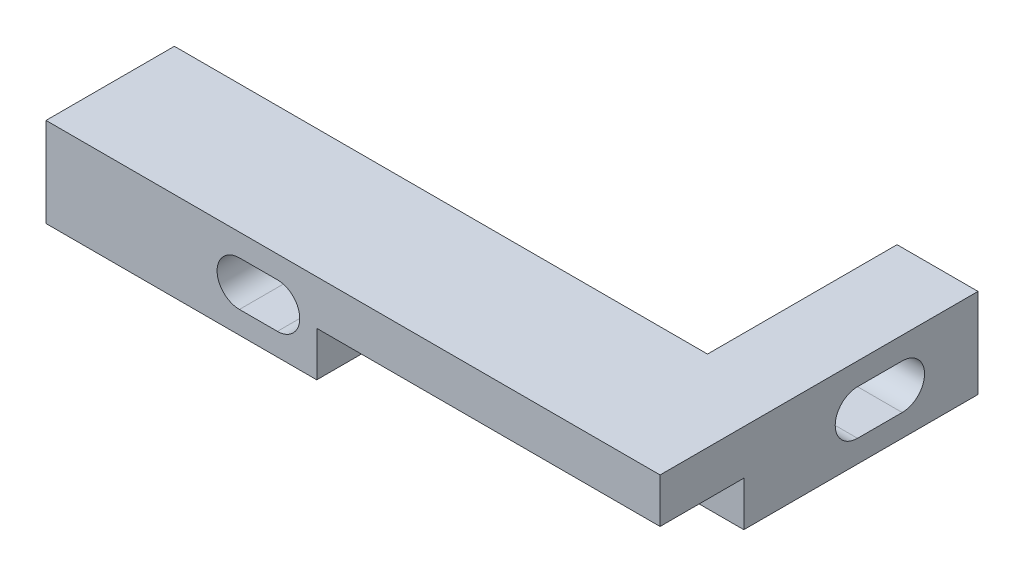
ISO-10303-21;
HEADER;
FILE_DESCRIPTION(('STEP AP214'),'2;1');
FILE_NAME('part.step','',(''),(''),'','','');
FILE_SCHEMA(('AUTOMOTIVE_DESIGN { 1 0 10303 214 1 1 1 1 }'));
ENDSEC;
DATA;
#1=APPLICATION_CONTEXT('core data for automotive mechanical design processes');
#2=APPLICATION_PROTOCOL_DEFINITION('international standard','automotive_design',2000,#1);
#3=PRODUCT_CONTEXT('',#1,'mechanical');
#4=PRODUCT('Part','Part','',(#3));
#5=PRODUCT_RELATED_PRODUCT_CATEGORY('part','',(#4));
#6=PRODUCT_DEFINITION_FORMATION('','',#4);
#7=PRODUCT_DEFINITION_CONTEXT('part definition',#1,'design');
#8=PRODUCT_DEFINITION('design','',#6,#7);
#9=PRODUCT_DEFINITION_SHAPE('','',#8);
#10=(LENGTH_UNIT() NAMED_UNIT(*) SI_UNIT(.MILLI.,.METRE.));
#11=(NAMED_UNIT(*) PLANE_ANGLE_UNIT() SI_UNIT($,.RADIAN.));
#12=(NAMED_UNIT(*) SI_UNIT($,.STERADIAN.) SOLID_ANGLE_UNIT());
#13=UNCERTAINTY_MEASURE_WITH_UNIT(LENGTH_MEASURE(1.E-05),#10,'distance_accuracy_value','');
#14=(GEOMETRIC_REPRESENTATION_CONTEXT(3) GLOBAL_UNCERTAINTY_ASSIGNED_CONTEXT((#13)) GLOBAL_UNIT_ASSIGNED_CONTEXT((#10,
#11,#12)) REPRESENTATION_CONTEXT('',''));
#15=CARTESIAN_POINT('',(0.,0.,0.));
#16=DIRECTION('',(0.,0.,1.));
#17=DIRECTION('',(1.,0.,0.));
#18=AXIS2_PLACEMENT_3D('',#15,#16,#17);
#19=CARTESIAN_POINT('',(55.,0.,0.));
#20=DIRECTION('',(0.,1.,0.));
#21=DIRECTION('',(0.,0.,1.));
#22=AXIS2_PLACEMENT_3D('',#19,#20,#21);
#23=PLANE('',#22);
#24=DIRECTION('',(0.,0.,-1.));
#25=VECTOR('',#24,1.);
#26=CARTESIAN_POINT('',(51.75,0.,12.5));
#27=LINE('',#26,#25);
#28=CARTESIAN_POINT('',(51.75,0.,20.));
#29=VERTEX_POINT('',#28);
#30=CARTESIAN_POINT('',(51.75,0.,8.5));
#31=VERTEX_POINT('',#30);
#32=EDGE_CURVE('E239',#29,#31,#27,.T.);
#33=ORIENTED_EDGE('',*,*,#32,.T.);
#34=DIRECTION('',(-1.,0.,0.));
#35=VECTOR('',#34,1.);
#36=CARTESIAN_POINT('',(75.25,0.,8.5));
#37=LINE('',#36,#35);
#38=CARTESIAN_POINT('',(75.25,0.,8.5));
#39=VERTEX_POINT('',#38);
#40=EDGE_CURVE('E273',#39,#31,#37,.T.);
#41=ORIENTED_EDGE('',*,*,#40,.F.);
#42=DIRECTION('',(0.,0.,-1.));
#43=VECTOR('',#42,1.);
#44=CARTESIAN_POINT('',(75.25,0.,0.));
#45=LINE('',#44,#43);
#46=CARTESIAN_POINT('',(75.25,0.,12.5));
#47=VERTEX_POINT('',#46);
#48=EDGE_CURVE('E260',#47,#39,#45,.T.);
#49=ORIENTED_EDGE('',*,*,#48,.F.);
#50=DIRECTION('',(-1.,0.,0.));
#51=VECTOR('',#50,1.);
#52=CARTESIAN_POINT('',(82.5,0.,12.5));
#53=LINE('',#52,#51);
#54=CARTESIAN_POINT('',(82.5,0.,12.5));
#55=VERTEX_POINT('',#54);
#56=EDGE_CURVE('E223',#55,#47,#53,.T.);
#57=ORIENTED_EDGE('',*,*,#56,.F.);
#58=DIRECTION('',(0.,0.,-1.));
#59=VECTOR('',#58,1.);
#60=CARTESIAN_POINT('',(82.5,0.,20.));
#61=LINE('',#60,#59);
#62=CARTESIAN_POINT('',(82.5,0.,20.));
#63=VERTEX_POINT('',#62);
#64=EDGE_CURVE('E234',#63,#55,#61,.T.);
#65=ORIENTED_EDGE('',*,*,#64,.F.);
#66=DIRECTION('',(-1.,0.,0.));
#67=VECTOR('',#66,1.);
#68=CARTESIAN_POINT('',(82.5,0.,20.));
#69=LINE('',#68,#67);
#70=EDGE_CURVE('E226',#63,#29,#69,.T.);
#71=ORIENTED_EDGE('',*,*,#70,.T.);
#72=EDGE_LOOP('',(#33,#41,#49,#57,#65,#71));
#73=FACE_BOUND('',#72,.T.);
#74=ADVANCED_FACE('F35',(#73),#23,.F.);
#75=CARTESIAN_POINT('',(82.5,4.,12.5));
#76=DIRECTION('',(0.,0.,-1.));
#77=DIRECTION('',(1.,0.,0.));
#78=AXIS2_PLACEMENT_3D('',#75,#76,#77);
#79=PLANE('',#78);
#80=ORIENTED_EDGE('',*,*,#56,.T.);
#81=DIRECTION('',(0.,1.,0.));
#82=VECTOR('',#81,1.);
#83=CARTESIAN_POINT('',(75.25,-4.,12.5));
#84=LINE('',#83,#82);
#85=CARTESIAN_POINT('',(75.25,-4.,12.5));
#86=VERTEX_POINT('',#85);
#87=EDGE_CURVE('E258',#86,#47,#84,.T.);
#88=ORIENTED_EDGE('',*,*,#87,.F.);
#89=DIRECTION('',(-1.,0.,0.));
#90=VECTOR('',#89,1.);
#91=CARTESIAN_POINT('',(82.5,-4.,12.5));
#92=LINE('',#91,#90);
#93=CARTESIAN_POINT('',(82.5,-4.,12.5));
#94=VERTEX_POINT('',#93);
#95=EDGE_CURVE('E250',#94,#86,#92,.T.);
#96=ORIENTED_EDGE('',*,*,#95,.F.);
#97=DIRECTION('',(0.,-1.,0.));
#98=VECTOR('',#97,1.);
#99=CARTESIAN_POINT('',(82.5,4.,12.5));
#100=LINE('',#99,#98);
#101=EDGE_CURVE('E288',#55,#94,#100,.T.);
#102=ORIENTED_EDGE('',*,*,#101,.F.);
#103=EDGE_LOOP('',(#80,#88,#96,#102));
#104=FACE_BOUND('',#103,.T.);
#105=ADVANCED_FACE('F333',(#104),#79,.F.);
#106=CARTESIAN_POINT('',(27.5,4.,-12.5));
#107=DIRECTION('',(1.,0.,0.));
#108=DIRECTION('',(0.,0.,1.));
#109=AXIS2_PLACEMENT_3D('',#106,#107,#108);
#110=PLANE('',#109);
#111=DIRECTION('',(0.,0.,-1.));
#112=VECTOR('',#111,1.);
#113=CARTESIAN_POINT('',(27.5,-4.,-8.47465440443784));
#114=LINE('',#113,#112);
#115=CARTESIAN_POINT('',(27.5,-4.,20.));
#116=VERTEX_POINT('',#115);
#117=CARTESIAN_POINT('',(27.5,-4.,8.5));
#118=VERTEX_POINT('',#117);
#119=EDGE_CURVE('E263',#116,#118,#114,.T.);
#120=ORIENTED_EDGE('',*,*,#119,.F.);
#121=DIRECTION('',(0.,1.,0.));
#122=VECTOR('',#121,1.);
#123=CARTESIAN_POINT('',(27.5,4.,20.));
#124=LINE('',#123,#122);
#125=CARTESIAN_POINT('',(27.5,4.,20.));
#126=VERTEX_POINT('',#125);
#127=EDGE_CURVE('E229',#116,#126,#124,.T.);
#128=ORIENTED_EDGE('',*,*,#127,.T.);
#129=DIRECTION('',(0.,0.,-1.));
#130=VECTOR('',#129,1.);
#131=CARTESIAN_POINT('',(27.5,4.,-12.5));
#132=LINE('',#131,#130);
#133=CARTESIAN_POINT('',(27.5,4.,8.5));
#134=VERTEX_POINT('',#133);
#135=EDGE_CURVE('E282',#126,#134,#132,.T.);
#136=ORIENTED_EDGE('',*,*,#135,.T.);
#137=DIRECTION('',(0.,1.,0.));
#138=VECTOR('',#137,1.);
#139=CARTESIAN_POINT('',(27.5,-4.,8.5));
#140=LINE('',#139,#138);
#141=EDGE_CURVE('E211',#118,#134,#140,.T.);
#142=ORIENTED_EDGE('',*,*,#141,.F.);
#143=EDGE_LOOP('',(#120,#128,#136,#142));
#144=FACE_BOUND('',#143,.T.);
#145=ADVANCED_FACE('F37',(#144),#110,.F.);
#146=CARTESIAN_POINT('',(82.5,4.,-12.5));
#147=DIRECTION('',(-1.,0.,0.));
#148=DIRECTION('',(0.,0.,-1.));
#149=AXIS2_PLACEMENT_3D('',#146,#147,#148);
#150=PLANE('',#149);
#151=DIRECTION('',(0.,0.,-1.));
#152=VECTOR('',#151,1.);
#153=CARTESIAN_POINT('',(82.5,2.,2.31454912255757));
#154=LINE('',#153,#152);
#155=CARTESIAN_POINT('',(82.5,2.,2.31454912255757));
#156=VERTEX_POINT('',#155);
#157=CARTESIAN_POINT('',(82.5,2.,-1.68545087744243));
#158=VERTEX_POINT('',#157);
#159=EDGE_CURVE('E199',#156,#158,#154,.T.);
#160=ORIENTED_EDGE('',*,*,#159,.T.);
#161=CARTESIAN_POINT('',(82.5,0.,-1.68545087744243));
#162=DIRECTION('',(-1.,0.,0.));
#163=DIRECTION('',(0.,0.,1.));
#164=AXIS2_PLACEMENT_3D('',#161,#162,#163);
#165=CIRCLE('',#164,2.);
#166=CARTESIAN_POINT('',(82.5,-2.,-1.68545087744243));
#167=VERTEX_POINT('',#166);
#168=EDGE_CURVE('E202',#158,#167,#165,.T.);
#169=ORIENTED_EDGE('',*,*,#168,.T.);
#170=DIRECTION('',(0.,0.,1.));
#171=VECTOR('',#170,1.);
#172=CARTESIAN_POINT('',(82.5,-2.,2.31454912255757));
#173=LINE('',#172,#171);
#174=CARTESIAN_POINT('',(82.5,-2.,2.31454912255757));
#175=VERTEX_POINT('',#174);
#176=EDGE_CURVE('E205',#167,#175,#173,.T.);
#177=ORIENTED_EDGE('',*,*,#176,.T.);
#178=CARTESIAN_POINT('',(82.5,0.,2.31454912255757));
#179=DIRECTION('',(-1.,0.,0.));
#180=DIRECTION('',(0.,0.,1.));
#181=AXIS2_PLACEMENT_3D('',#178,#179,#180);
#182=CIRCLE('',#181,2.);
#183=EDGE_CURVE('E196',#175,#156,#182,.T.);
#184=ORIENTED_EDGE('',*,*,#183,.T.);
#185=EDGE_LOOP('',(#160,#169,#177,#184));
#186=FACE_BOUND('',#185,.T.);
#187=DIRECTION('',(0.,0.,1.));
#188=VECTOR('',#187,1.);
#189=CARTESIAN_POINT('',(82.5,4.,-12.5));
#190=LINE('',#189,#188);
#191=CARTESIAN_POINT('',(82.5,4.,-8.47465440443784));
#192=VERTEX_POINT('',#191);
#193=CARTESIAN_POINT('',(82.5,4.,20.));
#194=VERTEX_POINT('',#193);
#195=EDGE_CURVE('E285',#192,#194,#190,.T.);
#196=ORIENTED_EDGE('',*,*,#195,.T.);
#197=DIRECTION('',(0.,-1.,0.));
#198=VECTOR('',#197,1.);
#199=CARTESIAN_POINT('',(82.5,4.,20.));
#200=LINE('',#199,#198);
#201=EDGE_CURVE('E224',#194,#63,#200,.T.);
#202=ORIENTED_EDGE('',*,*,#201,.T.);
#203=ORIENTED_EDGE('',*,*,#64,.T.);
#204=ORIENTED_EDGE('',*,*,#101,.T.);
#205=DIRECTION('',(0.,0.,1.));
#206=VECTOR('',#205,1.);
#207=CARTESIAN_POINT('',(82.5,-4.,12.5));
#208=LINE('',#207,#206);
#209=CARTESIAN_POINT('',(82.5,-4.,-8.47465440443784));
#210=VERTEX_POINT('',#209);
#211=EDGE_CURVE('E248',#210,#94,#208,.T.);
#212=ORIENTED_EDGE('',*,*,#211,.F.);
#213=DIRECTION('',(0.,1.,0.));
#214=VECTOR('',#213,1.);
#215=CARTESIAN_POINT('',(82.5,0.,-8.47465440443784));
#216=LINE('',#215,#214);
#217=EDGE_CURVE('E269',#210,#192,#216,.T.);
#218=ORIENTED_EDGE('',*,*,#217,.T.);
#219=EDGE_LOOP('',(#196,#202,#203,#204,#212,#218));
#220=FACE_BOUND('',#219,.T.);
#221=ADVANCED_FACE('F314',(#186,#220),#150,.F.);
#222=CARTESIAN_POINT('',(55.,4.,0.));
#223=DIRECTION('',(0.,1.,0.));
#224=DIRECTION('',(0.,0.,1.));
#225=AXIS2_PLACEMENT_3D('',#222,#223,#224);
#226=PLANE('',#225);
#227=ORIENTED_EDGE('',*,*,#135,.F.);
#228=DIRECTION('',(1.,0.,0.));
#229=VECTOR('',#228,1.);
#230=CARTESIAN_POINT('',(82.5,4.,20.));
#231=LINE('',#230,#229);
#232=EDGE_CURVE('E232',#126,#194,#231,.T.);
#233=ORIENTED_EDGE('',*,*,#232,.T.);
#234=ORIENTED_EDGE('',*,*,#195,.F.);
#235=DIRECTION('',(-1.,0.,0.));
#236=VECTOR('',#235,1.);
#237=CARTESIAN_POINT('',(82.5,4.,-8.47465440443784));
#238=LINE('',#237,#236);
#239=CARTESIAN_POINT('',(75.25,4.,-8.47465440443784));
#240=VERTEX_POINT('',#239);
#241=EDGE_CURVE('E266',#192,#240,#238,.T.);
#242=ORIENTED_EDGE('',*,*,#241,.T.);
#243=DIRECTION('',(0.,0.,1.));
#244=VECTOR('',#243,1.);
#245=CARTESIAN_POINT('',(75.25,4.,-8.5));
#246=LINE('',#245,#244);
#247=CARTESIAN_POINT('',(75.25,4.,8.5));
#248=VERTEX_POINT('',#247);
#249=EDGE_CURVE('E272',#240,#248,#246,.T.);
#250=ORIENTED_EDGE('',*,*,#249,.T.);
#251=DIRECTION('',(-1.,0.,0.));
#252=VECTOR('',#251,1.);
#253=CARTESIAN_POINT('',(75.25,4.,8.5));
#254=LINE('',#253,#252);
#255=EDGE_CURVE('E277',#248,#134,#254,.T.);
#256=ORIENTED_EDGE('',*,*,#255,.T.);
#257=EDGE_LOOP('',(#227,#233,#234,#242,#250,#256));
#258=FACE_BOUND('',#257,.T.);
#259=ADVANCED_FACE('F342',(#258),#226,.T.);
#260=CARTESIAN_POINT('',(75.25,0.,8.5));
#261=DIRECTION('',(0.,0.,1.));
#262=DIRECTION('',(-1.,0.,0.));
#263=AXIS2_PLACEMENT_3D('',#260,#261,#262);
#264=PLANE('',#263);
#265=DIRECTION('',(1.,0.,0.));
#266=VECTOR('',#265,1.);
#267=CARTESIAN_POINT('',(75.25,1.99999999999999,8.5));
#268=LINE('',#267,#266);
#269=CARTESIAN_POINT('',(44.8252375293289,1.99999999999999,8.5));
#270=VERTEX_POINT('',#269);
#271=CARTESIAN_POINT('',(48.2252375293289,1.99999999999999,8.5));
#272=VERTEX_POINT('',#271);
#273=EDGE_CURVE('E191',#270,#272,#268,.T.);
#274=ORIENTED_EDGE('',*,*,#273,.F.);
#275=CARTESIAN_POINT('',(44.8252375293289,0.,8.5));
#276=DIRECTION('',(0.,0.,-1.));
#277=DIRECTION('',(-1.,0.,0.));
#278=AXIS2_PLACEMENT_3D('',#275,#276,#277);
#279=CIRCLE('',#278,2.);
#280=CARTESIAN_POINT('',(44.8252375293289,-2.00000000000001,8.5));
#281=VERTEX_POINT('',#280);
#282=EDGE_CURVE('E189',#281,#270,#279,.T.);
#283=ORIENTED_EDGE('',*,*,#282,.F.);
#284=DIRECTION('',(-1.,0.,0.));
#285=VECTOR('',#284,1.);
#286=CARTESIAN_POINT('',(75.25,-2.00000000000001,8.5));
#287=LINE('',#286,#285);
#288=CARTESIAN_POINT('',(48.2252375293289,-2.00000000000001,8.5));
#289=VERTEX_POINT('',#288);
#290=EDGE_CURVE('E165',#289,#281,#287,.T.);
#291=ORIENTED_EDGE('',*,*,#290,.F.);
#292=CARTESIAN_POINT('',(48.2252375293289,0.,8.5));
#293=DIRECTION('',(0.,0.,-1.));
#294=DIRECTION('',(-1.,0.,0.));
#295=AXIS2_PLACEMENT_3D('',#292,#293,#294);
#296=CIRCLE('',#295,2.);
#297=EDGE_CURVE('E194',#272,#289,#296,.T.);
#298=ORIENTED_EDGE('',*,*,#297,.F.);
#299=EDGE_LOOP('',(#274,#283,#291,#298));
#300=FACE_BOUND('',#299,.T.);
#301=ORIENTED_EDGE('',*,*,#255,.F.);
#302=DIRECTION('',(0.,1.,0.));
#303=VECTOR('',#302,1.);
#304=CARTESIAN_POINT('',(75.25,0.,8.5));
#305=LINE('',#304,#303);
#306=EDGE_CURVE('E276',#39,#248,#305,.T.);
#307=ORIENTED_EDGE('',*,*,#306,.F.);
#308=ORIENTED_EDGE('',*,*,#40,.T.);
#309=DIRECTION('',(0.,1.,0.));
#310=VECTOR('',#309,1.);
#311=CARTESIAN_POINT('',(51.75,-4.,8.5));
#312=LINE('',#311,#310);
#313=CARTESIAN_POINT('',(51.75,-4.,8.5));
#314=VERTEX_POINT('',#313);
#315=EDGE_CURVE('E244',#314,#31,#312,.T.);
#316=ORIENTED_EDGE('',*,*,#315,.F.);
#317=DIRECTION('',(-1.,0.,0.));
#318=VECTOR('',#317,1.);
#319=CARTESIAN_POINT('',(34.75,-4.,8.5));
#320=LINE('',#319,#318);
#321=EDGE_CURVE('E242',#314,#118,#320,.T.);
#322=ORIENTED_EDGE('',*,*,#321,.T.);
#323=ORIENTED_EDGE('',*,*,#141,.T.);
#324=EDGE_LOOP('',(#301,#307,#308,#316,#322,#323));
#325=FACE_BOUND('',#324,.T.);
#326=ADVANCED_FACE('F349',(#300,#325),#264,.F.);
#327=CARTESIAN_POINT('',(75.25,0.,-8.5));
#328=DIRECTION('',(1.,0.,0.));
#329=DIRECTION('',(0.,0.,1.));
#330=AXIS2_PLACEMENT_3D('',#327,#328,#329);
#331=PLANE('',#330);
#332=DIRECTION('',(0.,0.,1.));
#333=VECTOR('',#332,1.);
#334=CARTESIAN_POINT('',(75.25,-2.,-8.5));
#335=LINE('',#334,#333);
#336=CARTESIAN_POINT('',(75.25,-2.,-1.68545087744243));
#337=VERTEX_POINT('',#336);
#338=CARTESIAN_POINT('',(75.25,-2.,2.31454912255757));
#339=VERTEX_POINT('',#338);
#340=EDGE_CURVE('E43',#337,#339,#335,.T.);
#341=ORIENTED_EDGE('',*,*,#340,.F.);
#342=CARTESIAN_POINT('',(75.25,0.,-1.68545087744243));
#343=DIRECTION('',(-1.,0.,0.));
#344=DIRECTION('',(0.,0.,1.));
#345=AXIS2_PLACEMENT_3D('',#342,#343,#344);
#346=CIRCLE('',#345,2.);
#347=CARTESIAN_POINT('',(75.25,2.,-1.68545087744243));
#348=VERTEX_POINT('',#347);
#349=EDGE_CURVE('E296',#348,#337,#346,.T.);
#350=ORIENTED_EDGE('',*,*,#349,.F.);
#351=DIRECTION('',(0.,0.,-1.));
#352=VECTOR('',#351,1.);
#353=CARTESIAN_POINT('',(75.25,2.,-8.5));
#354=LINE('',#353,#352);
#355=CARTESIAN_POINT('',(75.25,2.,2.31454912255757));
#356=VERTEX_POINT('',#355);
#357=EDGE_CURVE('E293',#356,#348,#354,.T.);
#358=ORIENTED_EDGE('',*,*,#357,.F.);
#359=CARTESIAN_POINT('',(75.25,0.,2.31454912255757));
#360=DIRECTION('',(-1.,0.,0.));
#361=DIRECTION('',(0.,0.,1.));
#362=AXIS2_PLACEMENT_3D('',#359,#360,#361);
#363=CIRCLE('',#362,2.);
#364=EDGE_CURVE('E11',#339,#356,#363,.T.);
#365=ORIENTED_EDGE('',*,*,#364,.F.);
#366=EDGE_LOOP('',(#341,#350,#358,#365));
#367=FACE_BOUND('',#366,.T.);
#368=ORIENTED_EDGE('',*,*,#306,.T.);
#369=ORIENTED_EDGE('',*,*,#249,.F.);
#370=DIRECTION('',(0.,1.,0.));
#371=VECTOR('',#370,1.);
#372=CARTESIAN_POINT('',(75.25,0.,-8.47465440443784));
#373=LINE('',#372,#371);
#374=CARTESIAN_POINT('',(75.25,-4.,-8.47465440443784));
#375=VERTEX_POINT('',#374);
#376=EDGE_CURVE('E291',#375,#240,#373,.T.);
#377=ORIENTED_EDGE('',*,*,#376,.F.);
#378=DIRECTION('',(0.,0.,-1.));
#379=VECTOR('',#378,1.);
#380=CARTESIAN_POINT('',(75.25,-4.,12.5));
#381=LINE('',#380,#379);
#382=EDGE_CURVE('E253',#86,#375,#381,.T.);
#383=ORIENTED_EDGE('',*,*,#382,.F.);
#384=ORIENTED_EDGE('',*,*,#87,.T.);
#385=ORIENTED_EDGE('',*,*,#48,.T.);
#386=EDGE_LOOP('',(#368,#369,#377,#383,#384,#385));
#387=FACE_BOUND('',#386,.T.);
#388=ADVANCED_FACE('F307',(#367,#387),#331,.F.);
#389=CARTESIAN_POINT('',(82.5,0.,-8.47465440443784));
#390=DIRECTION('',(0.,0.,1.));
#391=DIRECTION('',(-1.,0.,0.));
#392=AXIS2_PLACEMENT_3D('',#389,#390,#391);
#393=PLANE('',#392);
#394=ORIENTED_EDGE('',*,*,#376,.T.);
#395=ORIENTED_EDGE('',*,*,#241,.F.);
#396=ORIENTED_EDGE('',*,*,#217,.F.);
#397=DIRECTION('',(1.,0.,0.));
#398=VECTOR('',#397,1.);
#399=CARTESIAN_POINT('',(82.5,-4.,-8.47465440443784));
#400=LINE('',#399,#398);
#401=EDGE_CURVE('E256',#375,#210,#400,.T.);
#402=ORIENTED_EDGE('',*,*,#401,.F.);
#403=EDGE_LOOP('',(#394,#395,#396,#402));
#404=FACE_BOUND('',#403,.T.);
#405=ADVANCED_FACE('F381',(#404),#393,.F.);
#406=CARTESIAN_POINT('',(55.,-4.,0.));
#407=DIRECTION('',(0.,1.,0.));
#408=DIRECTION('',(0.,0.,1.));
#409=AXIS2_PLACEMENT_3D('',#406,#407,#408);
#410=PLANE('',#409);
#411=ORIENTED_EDGE('',*,*,#321,.F.);
#412=DIRECTION('',(0.,0.,-1.));
#413=VECTOR('',#412,1.);
#414=CARTESIAN_POINT('',(51.75,-4.,12.5));
#415=LINE('',#414,#413);
#416=CARTESIAN_POINT('',(51.75,-4.,20.));
#417=VERTEX_POINT('',#416);
#418=EDGE_CURVE('E240',#417,#314,#415,.T.);
#419=ORIENTED_EDGE('',*,*,#418,.F.);
#420=DIRECTION('',(-1.,0.,0.));
#421=VECTOR('',#420,1.);
#422=CARTESIAN_POINT('',(51.75,-4.,20.));
#423=LINE('',#422,#421);
#424=EDGE_CURVE('E221',#417,#116,#423,.T.);
#425=ORIENTED_EDGE('',*,*,#424,.T.);
#426=ORIENTED_EDGE('',*,*,#119,.T.);
#427=EDGE_LOOP('',(#411,#419,#425,#426));
#428=FACE_BOUND('',#427,.T.);
#429=ADVANCED_FACE('F359',(#428),#410,.F.);
#430=CARTESIAN_POINT('',(55.,-4.,0.));
#431=DIRECTION('',(0.,-1.,0.));
#432=DIRECTION('',(0.,0.,-1.));
#433=AXIS2_PLACEMENT_3D('',#430,#431,#432);
#434=PLANE('',#433);
#435=ORIENTED_EDGE('',*,*,#211,.T.);
#436=ORIENTED_EDGE('',*,*,#95,.T.);
#437=ORIENTED_EDGE('',*,*,#382,.T.);
#438=ORIENTED_EDGE('',*,*,#401,.T.);
#439=EDGE_LOOP('',(#435,#436,#437,#438));
#440=FACE_BOUND('',#439,.T.);
#441=ADVANCED_FACE('F385',(#440),#434,.T.);
#442=CARTESIAN_POINT('',(51.75,-4.,12.5));
#443=DIRECTION('',(-1.,0.,0.));
#444=DIRECTION('',(0.,0.,-1.));
#445=AXIS2_PLACEMENT_3D('',#442,#443,#444);
#446=PLANE('',#445);
#447=ORIENTED_EDGE('',*,*,#32,.F.);
#448=DIRECTION('',(0.,-1.,0.));
#449=VECTOR('',#448,1.);
#450=CARTESIAN_POINT('',(51.75,0.,20.));
#451=LINE('',#450,#449);
#452=EDGE_CURVE('E219',#29,#417,#451,.T.);
#453=ORIENTED_EDGE('',*,*,#452,.T.);
#454=ORIENTED_EDGE('',*,*,#418,.T.);
#455=ORIENTED_EDGE('',*,*,#315,.T.);
#456=EDGE_LOOP('',(#447,#453,#454,#455));
#457=FACE_BOUND('',#456,.T.);
#458=ADVANCED_FACE('F373',(#457),#446,.F.);
#459=CARTESIAN_POINT('',(55.,0.,20.));
#460=DIRECTION('',(0.,0.,1.));
#461=DIRECTION('',(-1.,0.,0.));
#462=AXIS2_PLACEMENT_3D('',#459,#460,#461);
#463=PLANE('',#462);
#464=CARTESIAN_POINT('',(48.2252375293289,0.,20.));
#465=DIRECTION('',(0.,0.,-1.));
#466=DIRECTION('',(-1.,0.,0.));
#467=AXIS2_PLACEMENT_3D('',#464,#465,#466);
#468=CIRCLE('',#467,2.);
#469=CARTESIAN_POINT('',(48.2252375293289,1.99999999999999,20.));
#470=VERTEX_POINT('',#469);
#471=CARTESIAN_POINT('',(48.2252375293289,-2.00000000000001,20.));
#472=VERTEX_POINT('',#471);
#473=EDGE_CURVE('E179',#470,#472,#468,.T.);
#474=ORIENTED_EDGE('',*,*,#473,.T.);
#475=DIRECTION('',(-1.,0.,0.));
#476=VECTOR('',#475,1.);
#477=CARTESIAN_POINT('',(48.2252375293289,-2.00000000000001,20.));
#478=LINE('',#477,#476);
#479=CARTESIAN_POINT('',(44.8252375293289,-2.00000000000001,20.));
#480=VERTEX_POINT('',#479);
#481=EDGE_CURVE('E162',#472,#480,#478,.T.);
#482=ORIENTED_EDGE('',*,*,#481,.T.);
#483=CARTESIAN_POINT('',(44.8252375293289,0.,20.));
#484=DIRECTION('',(0.,0.,-1.));
#485=DIRECTION('',(-1.,0.,0.));
#486=AXIS2_PLACEMENT_3D('',#483,#484,#485);
#487=CIRCLE('',#486,2.);
#488=CARTESIAN_POINT('',(44.8252375293289,1.99999999999999,20.));
#489=VERTEX_POINT('',#488);
#490=EDGE_CURVE('E170',#480,#489,#487,.T.);
#491=ORIENTED_EDGE('',*,*,#490,.T.);
#492=DIRECTION('',(1.,0.,0.));
#493=VECTOR('',#492,1.);
#494=CARTESIAN_POINT('',(48.2252375293289,1.99999999999999,20.));
#495=LINE('',#494,#493);
#496=EDGE_CURVE('E175',#489,#470,#495,.T.);
#497=ORIENTED_EDGE('',*,*,#496,.T.);
#498=EDGE_LOOP('',(#474,#482,#491,#497));
#499=FACE_BOUND('',#498,.T.);
#500=ORIENTED_EDGE('',*,*,#201,.F.);
#501=ORIENTED_EDGE('',*,*,#232,.F.);
#502=ORIENTED_EDGE('',*,*,#127,.F.);
#503=ORIENTED_EDGE('',*,*,#424,.F.);
#504=ORIENTED_EDGE('',*,*,#452,.F.);
#505=ORIENTED_EDGE('',*,*,#70,.F.);
#506=EDGE_LOOP('',(#500,#501,#502,#503,#504,#505));
#507=FACE_BOUND('',#506,.T.);
#508=ADVANCED_FACE('F177',(#499,#507),#463,.T.);
#509=CARTESIAN_POINT('',(27.5,0.,2.31454912255757));
#510=DIRECTION('',(1.,0.,0.));
#511=DIRECTION('',(0.,0.,1.));
#512=AXIS2_PLACEMENT_3D('',#509,#510,#511);
#513=CYLINDRICAL_SURFACE('',#512,2.);
#514=DIRECTION('',(1.,0.,0.));
#515=VECTOR('',#514,1.);
#516=CARTESIAN_POINT('',(27.5,-2.,2.31454912255757));
#517=LINE('',#516,#515);
#518=EDGE_CURVE('E209',#339,#175,#517,.T.);
#519=ORIENTED_EDGE('',*,*,#518,.F.);
#520=ORIENTED_EDGE('',*,*,#364,.T.);
#521=DIRECTION('',(1.,0.,0.));
#522=VECTOR('',#521,1.);
#523=CARTESIAN_POINT('',(27.5,2.,2.31454912255757));
#524=LINE('',#523,#522);
#525=EDGE_CURVE('E208',#356,#156,#524,.T.);
#526=ORIENTED_EDGE('',*,*,#525,.T.);
#527=ORIENTED_EDGE('',*,*,#183,.F.);
#528=EDGE_LOOP('',(#519,#520,#526,#527));
#529=FACE_BOUND('',#528,.T.);
#530=ADVANCED_FACE('F311',(#529),#513,.F.);
#531=CARTESIAN_POINT('',(27.5,-2.,2.31454912255757));
#532=DIRECTION('',(0.,-1.,0.));
#533=DIRECTION('',(0.,0.,-1.));
#534=AXIS2_PLACEMENT_3D('',#531,#532,#533);
#535=PLANE('',#534);
#536=DIRECTION('',(1.,0.,0.));
#537=VECTOR('',#536,1.);
#538=CARTESIAN_POINT('',(27.5,-2.,-1.68545087744243));
#539=LINE('',#538,#537);
#540=EDGE_CURVE('E212',#337,#167,#539,.T.);
#541=ORIENTED_EDGE('',*,*,#540,.F.);
#542=ORIENTED_EDGE('',*,*,#340,.T.);
#543=ORIENTED_EDGE('',*,*,#518,.T.);
#544=ORIENTED_EDGE('',*,*,#176,.F.);
#545=EDGE_LOOP('',(#541,#542,#543,#544));
#546=FACE_BOUND('',#545,.T.);
#547=ADVANCED_FACE('F301',(#546),#535,.F.);
#548=CARTESIAN_POINT('',(27.5,0.,-1.68545087744243));
#549=DIRECTION('',(1.,0.,0.));
#550=DIRECTION('',(0.,0.,1.));
#551=AXIS2_PLACEMENT_3D('',#548,#549,#550);
#552=CYLINDRICAL_SURFACE('',#551,2.);
#553=DIRECTION('',(1.,0.,0.));
#554=VECTOR('',#553,1.);
#555=CARTESIAN_POINT('',(27.5,2.,-1.68545087744243));
#556=LINE('',#555,#554);
#557=EDGE_CURVE('E214',#348,#158,#556,.T.);
#558=ORIENTED_EDGE('',*,*,#557,.F.);
#559=ORIENTED_EDGE('',*,*,#349,.T.);
#560=ORIENTED_EDGE('',*,*,#540,.T.);
#561=ORIENTED_EDGE('',*,*,#168,.F.);
#562=EDGE_LOOP('',(#558,#559,#560,#561));
#563=FACE_BOUND('',#562,.T.);
#564=ADVANCED_FACE('F318',(#563),#552,.F.);
#565=CARTESIAN_POINT('',(27.5,2.,2.31454912255757));
#566=DIRECTION('',(0.,1.,0.));
#567=DIRECTION('',(0.,0.,1.));
#568=AXIS2_PLACEMENT_3D('',#565,#566,#567);
#569=PLANE('',#568);
#570=ORIENTED_EDGE('',*,*,#525,.F.);
#571=ORIENTED_EDGE('',*,*,#357,.T.);
#572=ORIENTED_EDGE('',*,*,#557,.T.);
#573=ORIENTED_EDGE('',*,*,#159,.F.);
#574=EDGE_LOOP('',(#570,#571,#572,#573));
#575=FACE_BOUND('',#574,.T.);
#576=ADVANCED_FACE('F320',(#575),#569,.F.);
#577=CARTESIAN_POINT('',(48.2252375293289,0.,-8.47465440443784));
#578=DIRECTION('',(0.,0.,1.));
#579=DIRECTION('',(-1.,0.,0.));
#580=AXIS2_PLACEMENT_3D('',#577,#578,#579);
#581=CYLINDRICAL_SURFACE('',#580,2.);
#582=DIRECTION('',(0.,0.,1.));
#583=VECTOR('',#582,1.);
#584=CARTESIAN_POINT('',(48.2252375293289,1.99999999999999,-8.47465440443784));
#585=LINE('',#584,#583);
#586=EDGE_CURVE('E184',#272,#470,#585,.T.);
#587=ORIENTED_EDGE('',*,*,#586,.F.);
#588=ORIENTED_EDGE('',*,*,#297,.T.);
#589=DIRECTION('',(0.,0.,1.));
#590=VECTOR('',#589,1.);
#591=CARTESIAN_POINT('',(48.2252375293289,-2.00000000000001,-8.47465440443784));
#592=LINE('',#591,#590);
#593=EDGE_CURVE('E58',#289,#472,#592,.T.);
#594=ORIENTED_EDGE('',*,*,#593,.T.);
#595=ORIENTED_EDGE('',*,*,#473,.F.);
#596=EDGE_LOOP('',(#587,#588,#594,#595));
#597=FACE_BOUND('',#596,.T.);
#598=ADVANCED_FACE('F322',(#597),#581,.F.);
#599=CARTESIAN_POINT('',(48.2252375293289,1.99999999999999,-8.47465440443784));
#600=DIRECTION('',(0.,1.,0.));
#601=DIRECTION('',(1.,0.,0.));
#602=AXIS2_PLACEMENT_3D('',#599,#600,#601);
#603=PLANE('',#602);
#604=DIRECTION('',(0.,0.,1.));
#605=VECTOR('',#604,1.);
#606=CARTESIAN_POINT('',(44.8252375293289,1.99999999999999,-8.47465440443784));
#607=LINE('',#606,#605);
#608=EDGE_CURVE('E167',#270,#489,#607,.T.);
#609=ORIENTED_EDGE('',*,*,#608,.F.);
#610=ORIENTED_EDGE('',*,*,#273,.T.);
#611=ORIENTED_EDGE('',*,*,#586,.T.);
#612=ORIENTED_EDGE('',*,*,#496,.F.);
#613=EDGE_LOOP('',(#609,#610,#611,#612));
#614=FACE_BOUND('',#613,.T.);
#615=ADVANCED_FACE('F328',(#614),#603,.F.);
#616=CARTESIAN_POINT('',(44.8252375293289,0.,-8.47465440443784));
#617=DIRECTION('',(0.,0.,1.));
#618=DIRECTION('',(-1.,0.,0.));
#619=AXIS2_PLACEMENT_3D('',#616,#617,#618);
#620=CYLINDRICAL_SURFACE('',#619,2.);
#621=DIRECTION('',(0.,0.,1.));
#622=VECTOR('',#621,1.);
#623=CARTESIAN_POINT('',(44.8252375293289,-2.00000000000001,-8.47465440443784));
#624=LINE('',#623,#622);
#625=EDGE_CURVE('E50',#281,#480,#624,.T.);
#626=ORIENTED_EDGE('',*,*,#625,.F.);
#627=ORIENTED_EDGE('',*,*,#282,.T.);
#628=ORIENTED_EDGE('',*,*,#608,.T.);
#629=ORIENTED_EDGE('',*,*,#490,.F.);
#630=EDGE_LOOP('',(#626,#627,#628,#629));
#631=FACE_BOUND('',#630,.T.);
#632=ADVANCED_FACE('F171',(#631),#620,.F.);
#633=CARTESIAN_POINT('',(48.2252375293289,-2.00000000000001,-8.47465440443784));
#634=DIRECTION('',(0.,-1.,0.));
#635=DIRECTION('',(-1.,0.,0.));
#636=AXIS2_PLACEMENT_3D('',#633,#634,#635);
#637=PLANE('',#636);
#638=ORIENTED_EDGE('',*,*,#593,.F.);
#639=ORIENTED_EDGE('',*,*,#290,.T.);
#640=ORIENTED_EDGE('',*,*,#625,.T.);
#641=ORIENTED_EDGE('',*,*,#481,.F.);
#642=EDGE_LOOP('',(#638,#639,#640,#641));
#643=FACE_BOUND('',#642,.T.);
#644=ADVANCED_FACE('F160',(#643),#637,.F.);
#645=CLOSED_SHELL('',(#74,#105,#145,#221,#259,#326,#388,#405,#429,#441,#458,#508,#530,#547,#564,
#576,#598,#615,#632,#644));
#646=MANIFOLD_SOLID_BREP('B2',#645);
#647=ADVANCED_BREP_SHAPE_REPRESENTATION('',(#18,#646),#14);
#648=SHAPE_DEFINITION_REPRESENTATION(#9,#647);
ENDSEC;
END-ISO-10303-21;
